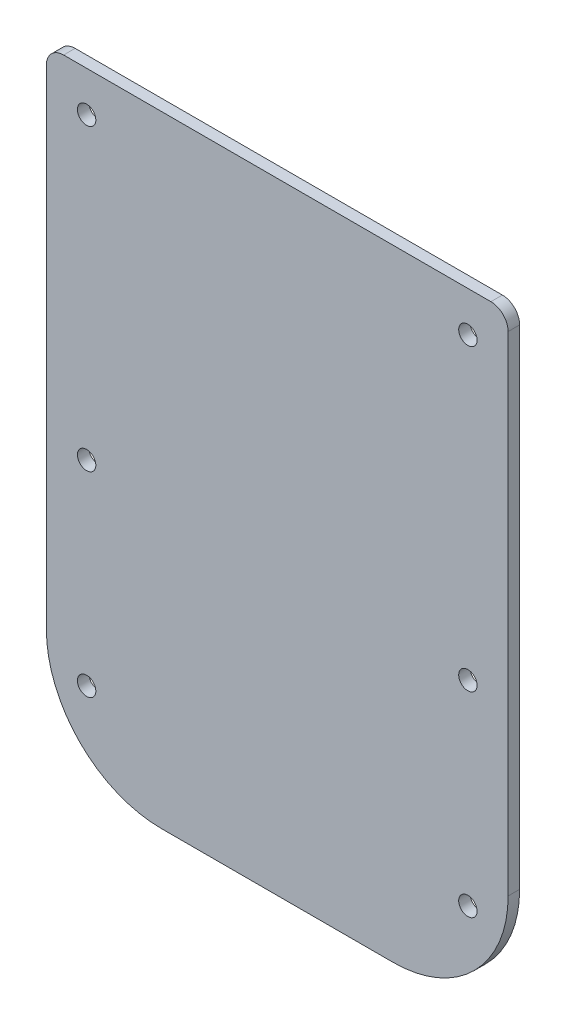
ISO-10303-21;
HEADER;
FILE_DESCRIPTION(('STEP AP214'),'2;1');
FILE_NAME('part.step','',(''),(''),'','','');
FILE_SCHEMA(('AUTOMOTIVE_DESIGN { 1 0 10303 214 1 1 1 1 }'));
ENDSEC;
DATA;
#1=APPLICATION_CONTEXT('core data for automotive mechanical design processes');
#2=APPLICATION_PROTOCOL_DEFINITION('international standard','automotive_design',2000,#1);
#3=PRODUCT_CONTEXT('',#1,'mechanical');
#4=PRODUCT('Part','Part','',(#3));
#5=PRODUCT_RELATED_PRODUCT_CATEGORY('part','',(#4));
#6=PRODUCT_DEFINITION_FORMATION('','',#4);
#7=PRODUCT_DEFINITION_CONTEXT('part definition',#1,'design');
#8=PRODUCT_DEFINITION('design','',#6,#7);
#9=PRODUCT_DEFINITION_SHAPE('','',#8);
#10=(LENGTH_UNIT() NAMED_UNIT(*) SI_UNIT(.MILLI.,.METRE.));
#11=(NAMED_UNIT(*) PLANE_ANGLE_UNIT() SI_UNIT($,.RADIAN.));
#12=(NAMED_UNIT(*) SI_UNIT($,.STERADIAN.) SOLID_ANGLE_UNIT());
#13=UNCERTAINTY_MEASURE_WITH_UNIT(LENGTH_MEASURE(1.E-05),#10,'distance_accuracy_value','');
#14=(GEOMETRIC_REPRESENTATION_CONTEXT(3) GLOBAL_UNCERTAINTY_ASSIGNED_CONTEXT((#13)) GLOBAL_UNIT_ASSIGNED_CONTEXT((#10,
#11,#12)) REPRESENTATION_CONTEXT('',''));
#15=CARTESIAN_POINT('',(0.,0.,0.));
#16=DIRECTION('',(0.,0.,1.));
#17=DIRECTION('',(1.,0.,0.));
#18=AXIS2_PLACEMENT_3D('',#15,#16,#17);
#19=CARTESIAN_POINT('',(0.,0.,2.));
#20=DIRECTION('',(1.,0.,0.));
#21=DIRECTION('',(0.,0.,-1.));
#22=AXIS2_PLACEMENT_3D('',#19,#20,#21);
#23=PLANE('',#22);
#24=DIRECTION('',(0.,-1.,0.));
#25=VECTOR('',#24,1.);
#26=CARTESIAN_POINT('',(0.,0.,0.));
#27=LINE('',#26,#25);
#28=CARTESIAN_POINT('',(0.,63.,0.));
#29=VERTEX_POINT('',#28);
#30=CARTESIAN_POINT('',(0.,-22.,0.));
#31=VERTEX_POINT('',#30);
#32=EDGE_CURVE('E130',#29,#31,#27,.T.);
#33=ORIENTED_EDGE('',*,*,#32,.T.);
#34=DIRECTION('',(0.,0.,-1.));
#35=VECTOR('',#34,1.);
#36=CARTESIAN_POINT('',(0.,-22.,2.));
#37=LINE('',#36,#35);
#38=CARTESIAN_POINT('',(0.,-22.,2.));
#39=VERTEX_POINT('',#38);
#40=EDGE_CURVE('E56',#31,#39,#37,.F.);
#41=ORIENTED_EDGE('',*,*,#40,.T.);
#42=DIRECTION('',(0.,-1.,0.));
#43=VECTOR('',#42,1.);
#44=CARTESIAN_POINT('',(0.,0.,2.));
#45=LINE('',#44,#43);
#46=CARTESIAN_POINT('',(0.,63.,2.));
#47=VERTEX_POINT('',#46);
#48=EDGE_CURVE('E125',#47,#39,#45,.T.);
#49=ORIENTED_EDGE('',*,*,#48,.F.);
#50=DIRECTION('',(0.,0.,-1.));
#51=VECTOR('',#50,1.);
#52=CARTESIAN_POINT('',(0.,63.,2.));
#53=LINE('',#52,#51);
#54=EDGE_CURVE('E141',#47,#29,#53,.T.);
#55=ORIENTED_EDGE('',*,*,#54,.T.);
#56=EDGE_LOOP('',(#33,#41,#49,#55));
#57=FACE_BOUND('',#56,.T.);
#58=ADVANCED_FACE('F33',(#57),#23,.F.);
#59=CARTESIAN_POINT('',(80.3,0.,2.));
#60=DIRECTION('',(-1.,0.,0.));
#61=DIRECTION('',(0.,0.,1.));
#62=AXIS2_PLACEMENT_3D('',#59,#60,#61);
#63=PLANE('',#62);
#64=DIRECTION('',(0.,1.,0.));
#65=VECTOR('',#64,1.);
#66=CARTESIAN_POINT('',(80.3,0.,2.));
#67=LINE('',#66,#65);
#68=CARTESIAN_POINT('',(80.3,-22.,2.));
#69=VERTEX_POINT('',#68);
#70=CARTESIAN_POINT('',(80.3,63.,2.));
#71=VERTEX_POINT('',#70);
#72=EDGE_CURVE('E128',#69,#71,#67,.T.);
#73=ORIENTED_EDGE('',*,*,#72,.F.);
#74=DIRECTION('',(0.,0.,1.));
#75=VECTOR('',#74,1.);
#76=CARTESIAN_POINT('',(80.3,-22.,0.));
#77=LINE('',#76,#75);
#78=CARTESIAN_POINT('',(80.3,-22.,0.));
#79=VERTEX_POINT('',#78);
#80=EDGE_CURVE('E11',#69,#79,#77,.F.);
#81=ORIENTED_EDGE('',*,*,#80,.T.);
#82=DIRECTION('',(0.,1.,0.));
#83=VECTOR('',#82,1.);
#84=CARTESIAN_POINT('',(80.3,0.,0.));
#85=LINE('',#84,#83);
#86=CARTESIAN_POINT('',(80.3,63.,0.));
#87=VERTEX_POINT('',#86);
#88=EDGE_CURVE('E126',#79,#87,#85,.T.);
#89=ORIENTED_EDGE('',*,*,#88,.T.);
#90=DIRECTION('',(0.,0.,-1.));
#91=VECTOR('',#90,1.);
#92=CARTESIAN_POINT('',(80.3,63.,2.));
#93=LINE('',#92,#91);
#94=EDGE_CURVE('E106',#87,#71,#93,.F.);
#95=ORIENTED_EDGE('',*,*,#94,.T.);
#96=EDGE_LOOP('',(#73,#81,#89,#95));
#97=FACE_BOUND('',#96,.T.);
#98=ADVANCED_FACE('F241',(#97),#63,.F.);
#99=CARTESIAN_POINT('',(0.,66.,2.));
#100=DIRECTION('',(0.,-1.,0.));
#101=DIRECTION('',(0.,0.,-1.));
#102=AXIS2_PLACEMENT_3D('',#99,#100,#101);
#103=PLANE('',#102);
#104=DIRECTION('',(-1.,0.,0.));
#105=VECTOR('',#104,1.);
#106=CARTESIAN_POINT('',(0.,66.,2.));
#107=LINE('',#106,#105);
#108=CARTESIAN_POINT('',(77.3,66.,2.));
#109=VERTEX_POINT('',#108);
#110=CARTESIAN_POINT('',(3.,66.,2.));
#111=VERTEX_POINT('',#110);
#112=EDGE_CURVE('E119',#109,#111,#107,.T.);
#113=ORIENTED_EDGE('',*,*,#112,.F.);
#114=DIRECTION('',(0.,0.,-1.));
#115=VECTOR('',#114,1.);
#116=CARTESIAN_POINT('',(77.3,66.,2.));
#117=LINE('',#116,#115);
#118=CARTESIAN_POINT('',(77.3,66.,0.));
#119=VERTEX_POINT('',#118);
#120=EDGE_CURVE('E104',#109,#119,#117,.T.);
#121=ORIENTED_EDGE('',*,*,#120,.T.);
#122=DIRECTION('',(-1.,0.,0.));
#123=VECTOR('',#122,1.);
#124=CARTESIAN_POINT('',(0.,66.,0.));
#125=LINE('',#124,#123);
#126=CARTESIAN_POINT('',(3.,66.,0.));
#127=VERTEX_POINT('',#126);
#128=EDGE_CURVE('E116',#119,#127,#125,.T.);
#129=ORIENTED_EDGE('',*,*,#128,.T.);
#130=DIRECTION('',(0.,0.,-1.));
#131=VECTOR('',#130,1.);
#132=CARTESIAN_POINT('',(3.,66.,2.));
#133=LINE('',#132,#131);
#134=EDGE_CURVE('E120',#127,#111,#133,.F.);
#135=ORIENTED_EDGE('',*,*,#134,.T.);
#136=EDGE_LOOP('',(#113,#121,#129,#135));
#137=FACE_BOUND('',#136,.T.);
#138=ADVANCED_FACE('F115',(#137),#103,.F.);
#139=CARTESIAN_POINT('',(0.,0.,2.));
#140=DIRECTION('',(0.,0.,-1.));
#141=DIRECTION('',(-1.,0.,0.));
#142=AXIS2_PLACEMENT_3D('',#139,#140,#141);
#143=PLANE('',#142);
#144=CARTESIAN_POINT('',(7.,-27.,2.));
#145=DIRECTION('',(0.,0.,1.));
#146=DIRECTION('',(1.,0.,0.));
#147=AXIS2_PLACEMENT_3D('',#144,#145,#146);
#148=CIRCLE('',#147,1.59999999999999);
#149=CARTESIAN_POINT('',(8.59999999999999,-27.,2.));
#150=VERTEX_POINT('',#149);
#151=EDGE_CURVE('E206',#150,#150,#148,.T.);
#152=ORIENTED_EDGE('',*,*,#151,.F.);
#153=EDGE_LOOP('',(#152));
#154=FACE_BOUND('',#153,.T.);
#155=CARTESIAN_POINT('',(73.3,-27.,2.));
#156=DIRECTION('',(0.,0.,1.));
#157=DIRECTION('',(1.,0.,0.));
#158=AXIS2_PLACEMENT_3D('',#155,#156,#157);
#159=CIRCLE('',#158,1.59999999999999);
#160=CARTESIAN_POINT('',(74.9,-27.,2.));
#161=VERTEX_POINT('',#160);
#162=EDGE_CURVE('E200',#161,#161,#159,.T.);
#163=ORIENTED_EDGE('',*,*,#162,.F.);
#164=EDGE_LOOP('',(#163));
#165=FACE_BOUND('',#164,.T.);
#166=CARTESIAN_POINT('',(7.,59.,2.));
#167=DIRECTION('',(0.,0.,1.));
#168=DIRECTION('',(1.,0.,0.));
#169=AXIS2_PLACEMENT_3D('',#166,#167,#168);
#170=CIRCLE('',#169,1.59999999999999);
#171=CARTESIAN_POINT('',(8.59999999999999,59.,2.));
#172=VERTEX_POINT('',#171);
#173=EDGE_CURVE('E165',#172,#172,#170,.T.);
#174=ORIENTED_EDGE('',*,*,#173,.F.);
#175=EDGE_LOOP('',(#174));
#176=FACE_BOUND('',#175,.T.);
#177=CARTESIAN_POINT('',(73.3,59.,2.));
#178=DIRECTION('',(0.,0.,1.));
#179=DIRECTION('',(1.,0.,0.));
#180=AXIS2_PLACEMENT_3D('',#177,#178,#179);
#181=CIRCLE('',#180,1.59999999999999);
#182=CARTESIAN_POINT('',(74.9,59.,2.));
#183=VERTEX_POINT('',#182);
#184=EDGE_CURVE('E188',#183,#183,#181,.T.);
#185=ORIENTED_EDGE('',*,*,#184,.F.);
#186=EDGE_LOOP('',(#185));
#187=FACE_BOUND('',#186,.T.);
#188=CARTESIAN_POINT('',(73.3,7.,2.));
#189=DIRECTION('',(0.,0.,1.));
#190=DIRECTION('',(1.,0.,0.));
#191=AXIS2_PLACEMENT_3D('',#188,#189,#190);
#192=CIRCLE('',#191,1.59999999999999);
#193=CARTESIAN_POINT('',(74.9,7.,2.));
#194=VERTEX_POINT('',#193);
#195=EDGE_CURVE('E182',#194,#194,#192,.T.);
#196=ORIENTED_EDGE('',*,*,#195,.F.);
#197=EDGE_LOOP('',(#196));
#198=FACE_BOUND('',#197,.T.);
#199=CARTESIAN_POINT('',(7.00000000000001,7.,2.));
#200=DIRECTION('',(0.,0.,1.));
#201=DIRECTION('',(1.,0.,0.));
#202=AXIS2_PLACEMENT_3D('',#199,#200,#201);
#203=CIRCLE('',#202,1.59999999999999);
#204=CARTESIAN_POINT('',(8.59999999999999,7.,2.));
#205=VERTEX_POINT('',#204);
#206=EDGE_CURVE('E172',#205,#205,#203,.T.);
#207=ORIENTED_EDGE('',*,*,#206,.F.);
#208=EDGE_LOOP('',(#207));
#209=FACE_BOUND('',#208,.T.);
#210=ORIENTED_EDGE('',*,*,#48,.T.);
#211=CARTESIAN_POINT('',(20.,-22.,2.));
#212=DIRECTION('',(0.,0.,-1.));
#213=DIRECTION('',(-1.,0.,0.));
#214=AXIS2_PLACEMENT_3D('',#211,#212,#213);
#215=CIRCLE('',#214,20.);
#216=CARTESIAN_POINT('',(20.,-42.,2.));
#217=VERTEX_POINT('',#216);
#218=EDGE_CURVE('E41',#39,#217,#215,.F.);
#219=ORIENTED_EDGE('',*,*,#218,.T.);
#220=DIRECTION('',(-1.,0.,0.));
#221=VECTOR('',#220,1.);
#222=CARTESIAN_POINT('',(80.3,-42.,2.));
#223=LINE('',#222,#221);
#224=CARTESIAN_POINT('',(60.3,-42.,2.));
#225=VERTEX_POINT('',#224);
#226=EDGE_CURVE('E158',#225,#217,#223,.T.);
#227=ORIENTED_EDGE('',*,*,#226,.F.);
#228=CARTESIAN_POINT('',(60.3,-22.,2.));
#229=DIRECTION('',(0.,0.,-1.));
#230=DIRECTION('',(-1.,0.,0.));
#231=AXIS2_PLACEMENT_3D('',#228,#229,#230);
#232=CIRCLE('',#231,20.);
#233=EDGE_CURVE('E48',#225,#69,#232,.F.);
#234=ORIENTED_EDGE('',*,*,#233,.T.);
#235=ORIENTED_EDGE('',*,*,#72,.T.);
#236=CARTESIAN_POINT('',(77.3,63.,2.));
#237=DIRECTION('',(0.,0.,-1.));
#238=DIRECTION('',(-1.,0.,0.));
#239=AXIS2_PLACEMENT_3D('',#236,#237,#238);
#240=CIRCLE('',#239,3.);
#241=EDGE_CURVE('E139',#71,#109,#240,.F.);
#242=ORIENTED_EDGE('',*,*,#241,.T.);
#243=ORIENTED_EDGE('',*,*,#112,.T.);
#244=CARTESIAN_POINT('',(3.,63.,2.));
#245=DIRECTION('',(0.,0.,-1.));
#246=DIRECTION('',(-1.,0.,0.));
#247=AXIS2_PLACEMENT_3D('',#244,#245,#246);
#248=CIRCLE('',#247,3.);
#249=EDGE_CURVE('E137',#111,#47,#248,.F.);
#250=ORIENTED_EDGE('',*,*,#249,.T.);
#251=EDGE_LOOP('',(#210,#219,#227,#234,#235,#242,#243,#250));
#252=FACE_BOUND('',#251,.T.);
#253=ADVANCED_FACE('F157',(#154,#165,#176,#187,#198,#209,#252),#143,.F.);
#254=CARTESIAN_POINT('',(0.,0.,0.));
#255=DIRECTION('',(0.,0.,-1.));
#256=DIRECTION('',(-1.,0.,0.));
#257=AXIS2_PLACEMENT_3D('',#254,#255,#256);
#258=PLANE('',#257);
#259=CARTESIAN_POINT('',(7.,-27.,0.));
#260=DIRECTION('',(0.,0.,-1.));
#261=DIRECTION('',(-1.,0.,0.));
#262=AXIS2_PLACEMENT_3D('',#259,#260,#261);
#263=CIRCLE('',#262,1.59999999999999);
#264=CARTESIAN_POINT('',(5.40000000000002,-27.,0.));
#265=VERTEX_POINT('',#264);
#266=EDGE_CURVE('E203',#265,#265,#263,.T.);
#267=ORIENTED_EDGE('',*,*,#266,.F.);
#268=EDGE_LOOP('',(#267));
#269=FACE_BOUND('',#268,.T.);
#270=CARTESIAN_POINT('',(73.3,-27.,0.));
#271=DIRECTION('',(0.,0.,-1.));
#272=DIRECTION('',(-1.,0.,0.));
#273=AXIS2_PLACEMENT_3D('',#270,#271,#272);
#274=CIRCLE('',#273,1.59999999999998);
#275=CARTESIAN_POINT('',(71.7,-27.,0.));
#276=VERTEX_POINT('',#275);
#277=EDGE_CURVE('E197',#276,#276,#274,.T.);
#278=ORIENTED_EDGE('',*,*,#277,.F.);
#279=EDGE_LOOP('',(#278));
#280=FACE_BOUND('',#279,.T.);
#281=CARTESIAN_POINT('',(7.,59.,0.));
#282=DIRECTION('',(0.,0.,1.));
#283=DIRECTION('',(1.,0.,0.));
#284=AXIS2_PLACEMENT_3D('',#281,#282,#283);
#285=CIRCLE('',#284,1.6);
#286=CARTESIAN_POINT('',(8.6,59.,0.));
#287=VERTEX_POINT('',#286);
#288=EDGE_CURVE('E191',#287,#287,#285,.T.);
#289=ORIENTED_EDGE('',*,*,#288,.T.);
#290=EDGE_LOOP('',(#289));
#291=FACE_BOUND('',#290,.T.);
#292=CARTESIAN_POINT('',(73.3,59.,0.));
#293=DIRECTION('',(0.,0.,1.));
#294=DIRECTION('',(1.,0.,0.));
#295=AXIS2_PLACEMENT_3D('',#292,#293,#294);
#296=CIRCLE('',#295,1.6);
#297=CARTESIAN_POINT('',(74.9,59.,0.));
#298=VERTEX_POINT('',#297);
#299=EDGE_CURVE('E185',#298,#298,#296,.T.);
#300=ORIENTED_EDGE('',*,*,#299,.T.);
#301=EDGE_LOOP('',(#300));
#302=FACE_BOUND('',#301,.T.);
#303=CARTESIAN_POINT('',(73.3,7.,0.));
#304=DIRECTION('',(0.,0.,1.));
#305=DIRECTION('',(1.,0.,0.));
#306=AXIS2_PLACEMENT_3D('',#303,#304,#305);
#307=CIRCLE('',#306,1.6);
#308=CARTESIAN_POINT('',(74.9,7.,0.));
#309=VERTEX_POINT('',#308);
#310=EDGE_CURVE('E179',#309,#309,#307,.T.);
#311=ORIENTED_EDGE('',*,*,#310,.T.);
#312=EDGE_LOOP('',(#311));
#313=FACE_BOUND('',#312,.T.);
#314=CARTESIAN_POINT('',(7.00000000000001,7.,0.));
#315=DIRECTION('',(0.,0.,1.));
#316=DIRECTION('',(1.,0.,0.));
#317=AXIS2_PLACEMENT_3D('',#314,#315,#316);
#318=CIRCLE('',#317,1.6);
#319=CARTESIAN_POINT('',(8.6,7.,0.));
#320=VERTEX_POINT('',#319);
#321=EDGE_CURVE('E170',#320,#320,#318,.T.);
#322=ORIENTED_EDGE('',*,*,#321,.T.);
#323=EDGE_LOOP('',(#322));
#324=FACE_BOUND('',#323,.T.);
#325=DIRECTION('',(1.,0.,0.));
#326=VECTOR('',#325,1.);
#327=CARTESIAN_POINT('',(0.,-42.,0.));
#328=LINE('',#327,#326);
#329=CARTESIAN_POINT('',(20.,-42.,0.));
#330=VERTEX_POINT('',#329);
#331=CARTESIAN_POINT('',(60.3,-42.,0.));
#332=VERTEX_POINT('',#331);
#333=EDGE_CURVE('E166',#330,#332,#328,.T.);
#334=ORIENTED_EDGE('',*,*,#333,.F.);
#335=CARTESIAN_POINT('',(20.,-22.,0.));
#336=DIRECTION('',(0.,0.,-1.));
#337=DIRECTION('',(-1.,0.,0.));
#338=AXIS2_PLACEMENT_3D('',#335,#336,#337);
#339=CIRCLE('',#338,20.);
#340=EDGE_CURVE('E152',#330,#31,#339,.T.);
#341=ORIENTED_EDGE('',*,*,#340,.T.);
#342=ORIENTED_EDGE('',*,*,#32,.F.);
#343=CARTESIAN_POINT('',(3.,63.,0.));
#344=DIRECTION('',(0.,0.,-1.));
#345=DIRECTION('',(-1.,0.,0.));
#346=AXIS2_PLACEMENT_3D('',#343,#344,#345);
#347=CIRCLE('',#346,3.);
#348=EDGE_CURVE('E110',#29,#127,#347,.T.);
#349=ORIENTED_EDGE('',*,*,#348,.T.);
#350=ORIENTED_EDGE('',*,*,#128,.F.);
#351=CARTESIAN_POINT('',(77.3,63.,0.));
#352=DIRECTION('',(0.,0.,-1.));
#353=DIRECTION('',(-1.,0.,0.));
#354=AXIS2_PLACEMENT_3D('',#351,#352,#353);
#355=CIRCLE('',#354,3.);
#356=EDGE_CURVE('E100',#119,#87,#355,.T.);
#357=ORIENTED_EDGE('',*,*,#356,.T.);
#358=ORIENTED_EDGE('',*,*,#88,.F.);
#359=CARTESIAN_POINT('',(60.3,-22.,0.));
#360=DIRECTION('',(0.,0.,-1.));
#361=DIRECTION('',(-1.,0.,0.));
#362=AXIS2_PLACEMENT_3D('',#359,#360,#361);
#363=CIRCLE('',#362,20.);
#364=EDGE_CURVE('E150',#79,#332,#363,.T.);
#365=ORIENTED_EDGE('',*,*,#364,.T.);
#366=EDGE_LOOP('',(#334,#341,#342,#349,#350,#357,#358,#365));
#367=FACE_BOUND('',#366,.T.);
#368=ADVANCED_FACE('F123',(#269,#280,#291,#302,#313,#324,#367),#258,.T.);
#369=CARTESIAN_POINT('',(7.00000000000001,7.,2.));
#370=DIRECTION('',(0.,0.,1.));
#371=DIRECTION('',(1.,0.,0.));
#372=AXIS2_PLACEMENT_3D('',#369,#370,#371);
#373=CYLINDRICAL_SURFACE('',#372,1.59999999999999);
#374=ORIENTED_EDGE('',*,*,#321,.F.);
#375=EDGE_LOOP('',(#374));
#376=FACE_BOUND('',#375,.T.);
#377=ORIENTED_EDGE('',*,*,#206,.T.);
#378=EDGE_LOOP('',(#377));
#379=FACE_BOUND('',#378,.T.);
#380=ADVANCED_FACE('F225',(#376,#379),#373,.F.);
#381=CARTESIAN_POINT('',(73.3,7.,2.));
#382=DIRECTION('',(0.,0.,1.));
#383=DIRECTION('',(1.,0.,0.));
#384=AXIS2_PLACEMENT_3D('',#381,#382,#383);
#385=CYLINDRICAL_SURFACE('',#384,1.6);
#386=ORIENTED_EDGE('',*,*,#310,.F.);
#387=EDGE_LOOP('',(#386));
#388=FACE_BOUND('',#387,.T.);
#389=ORIENTED_EDGE('',*,*,#195,.T.);
#390=EDGE_LOOP('',(#389));
#391=FACE_BOUND('',#390,.T.);
#392=ADVANCED_FACE('F227',(#388,#391),#385,.F.);
#393=CARTESIAN_POINT('',(73.3,59.,2.));
#394=DIRECTION('',(0.,0.,1.));
#395=DIRECTION('',(1.,0.,0.));
#396=AXIS2_PLACEMENT_3D('',#393,#394,#395);
#397=CYLINDRICAL_SURFACE('',#396,1.6);
#398=ORIENTED_EDGE('',*,*,#299,.F.);
#399=EDGE_LOOP('',(#398));
#400=FACE_BOUND('',#399,.T.);
#401=ORIENTED_EDGE('',*,*,#184,.T.);
#402=EDGE_LOOP('',(#401));
#403=FACE_BOUND('',#402,.T.);
#404=ADVANCED_FACE('F234',(#400,#403),#397,.F.);
#405=CARTESIAN_POINT('',(7.,59.,2.));
#406=DIRECTION('',(0.,0.,1.));
#407=DIRECTION('',(1.,0.,0.));
#408=AXIS2_PLACEMENT_3D('',#405,#406,#407);
#409=CYLINDRICAL_SURFACE('',#408,1.59999999999999);
#410=ORIENTED_EDGE('',*,*,#288,.F.);
#411=EDGE_LOOP('',(#410));
#412=FACE_BOUND('',#411,.T.);
#413=ORIENTED_EDGE('',*,*,#173,.T.);
#414=EDGE_LOOP('',(#413));
#415=FACE_BOUND('',#414,.T.);
#416=ADVANCED_FACE('F253',(#412,#415),#409,.F.);
#417=CARTESIAN_POINT('',(77.3,63.,2.));
#418=DIRECTION('',(0.,0.,-1.));
#419=DIRECTION('',(-1.,0.,0.));
#420=AXIS2_PLACEMENT_3D('',#417,#418,#419);
#421=CYLINDRICAL_SURFACE('',#420,3.);
#422=ORIENTED_EDGE('',*,*,#241,.F.);
#423=ORIENTED_EDGE('',*,*,#94,.F.);
#424=ORIENTED_EDGE('',*,*,#356,.F.);
#425=ORIENTED_EDGE('',*,*,#120,.F.);
#426=EDGE_LOOP('',(#422,#423,#424,#425));
#427=FACE_BOUND('',#426,.T.);
#428=ADVANCED_FACE('F103',(#427),#421,.T.);
#429=CARTESIAN_POINT('',(3.,63.,2.));
#430=DIRECTION('',(0.,0.,-1.));
#431=DIRECTION('',(-1.,0.,0.));
#432=AXIS2_PLACEMENT_3D('',#429,#430,#431);
#433=CYLINDRICAL_SURFACE('',#432,3.);
#434=ORIENTED_EDGE('',*,*,#249,.F.);
#435=ORIENTED_EDGE('',*,*,#134,.F.);
#436=ORIENTED_EDGE('',*,*,#348,.F.);
#437=ORIENTED_EDGE('',*,*,#54,.F.);
#438=EDGE_LOOP('',(#434,#435,#436,#437));
#439=FACE_BOUND('',#438,.T.);
#440=ADVANCED_FACE('F252',(#439),#433,.T.);
#441=CARTESIAN_POINT('',(0.,-42.,0.));
#442=DIRECTION('',(0.,-1.,0.));
#443=DIRECTION('',(0.,0.,-1.));
#444=AXIS2_PLACEMENT_3D('',#441,#442,#443);
#445=PLANE('',#444);
#446=ORIENTED_EDGE('',*,*,#226,.T.);
#447=DIRECTION('',(0.,0.,-1.));
#448=VECTOR('',#447,1.);
#449=CARTESIAN_POINT('',(20.,-42.,0.));
#450=LINE('',#449,#448);
#451=EDGE_CURVE('E147',#217,#330,#450,.T.);
#452=ORIENTED_EDGE('',*,*,#451,.T.);
#453=ORIENTED_EDGE('',*,*,#333,.T.);
#454=DIRECTION('',(0.,0.,1.));
#455=VECTOR('',#454,1.);
#456=CARTESIAN_POINT('',(60.3,-42.,2.));
#457=LINE('',#456,#455);
#458=EDGE_CURVE('E144',#332,#225,#457,.T.);
#459=ORIENTED_EDGE('',*,*,#458,.T.);
#460=EDGE_LOOP('',(#446,#452,#453,#459));
#461=FACE_BOUND('',#460,.T.);
#462=ADVANCED_FACE('F162',(#461),#445,.T.);
#463=CARTESIAN_POINT('',(20.,-22.,0.));
#464=DIRECTION('',(0.,0.,1.));
#465=DIRECTION('',(1.,0.,0.));
#466=AXIS2_PLACEMENT_3D('',#463,#464,#465);
#467=CYLINDRICAL_SURFACE('',#466,20.);
#468=ORIENTED_EDGE('',*,*,#218,.F.);
#469=ORIENTED_EDGE('',*,*,#40,.F.);
#470=ORIENTED_EDGE('',*,*,#340,.F.);
#471=ORIENTED_EDGE('',*,*,#451,.F.);
#472=EDGE_LOOP('',(#468,#469,#470,#471));
#473=FACE_BOUND('',#472,.T.);
#474=ADVANCED_FACE('F168',(#473),#467,.T.);
#475=CARTESIAN_POINT('',(60.3,-22.,0.));
#476=DIRECTION('',(0.,0.,-1.));
#477=DIRECTION('',(-1.,0.,0.));
#478=AXIS2_PLACEMENT_3D('',#475,#476,#477);
#479=CYLINDRICAL_SURFACE('',#478,20.);
#480=ORIENTED_EDGE('',*,*,#364,.F.);
#481=ORIENTED_EDGE('',*,*,#80,.F.);
#482=ORIENTED_EDGE('',*,*,#233,.F.);
#483=ORIENTED_EDGE('',*,*,#458,.F.);
#484=EDGE_LOOP('',(#480,#481,#482,#483));
#485=FACE_BOUND('',#484,.T.);
#486=ADVANCED_FACE('F35',(#485),#479,.T.);
#487=CARTESIAN_POINT('',(73.3,-27.,2.));
#488=DIRECTION('',(0.,0.,1.));
#489=DIRECTION('',(1.,0.,0.));
#490=AXIS2_PLACEMENT_3D('',#487,#488,#489);
#491=CYLINDRICAL_SURFACE('',#490,1.59999999999998);
#492=ORIENTED_EDGE('',*,*,#277,.T.);
#493=EDGE_LOOP('',(#492));
#494=FACE_BOUND('',#493,.T.);
#495=ORIENTED_EDGE('',*,*,#162,.T.);
#496=EDGE_LOOP('',(#495));
#497=FACE_BOUND('',#496,.T.);
#498=ADVANCED_FACE('F261',(#494,#497),#491,.F.);
#499=CARTESIAN_POINT('',(7.,-27.,2.));
#500=DIRECTION('',(0.,0.,1.));
#501=DIRECTION('',(1.,0.,0.));
#502=AXIS2_PLACEMENT_3D('',#499,#500,#501);
#503=CYLINDRICAL_SURFACE('',#502,1.59999999999999);
#504=ORIENTED_EDGE('',*,*,#266,.T.);
#505=EDGE_LOOP('',(#504));
#506=FACE_BOUND('',#505,.T.);
#507=ORIENTED_EDGE('',*,*,#151,.T.);
#508=EDGE_LOOP('',(#507));
#509=FACE_BOUND('',#508,.T.);
#510=ADVANCED_FACE('F210',(#506,#509),#503,.F.);
#511=CLOSED_SHELL('',(#58,#98,#138,#253,#368,#380,#392,#404,#416,#428,#440,#462,#474,#486,#498,#510));
#512=MANIFOLD_SOLID_BREP('B2',#511);
#513=ADVANCED_BREP_SHAPE_REPRESENTATION('',(#18,#512),#14);
#514=SHAPE_DEFINITION_REPRESENTATION(#9,#513);
ENDSEC;
END-ISO-10303-21;
